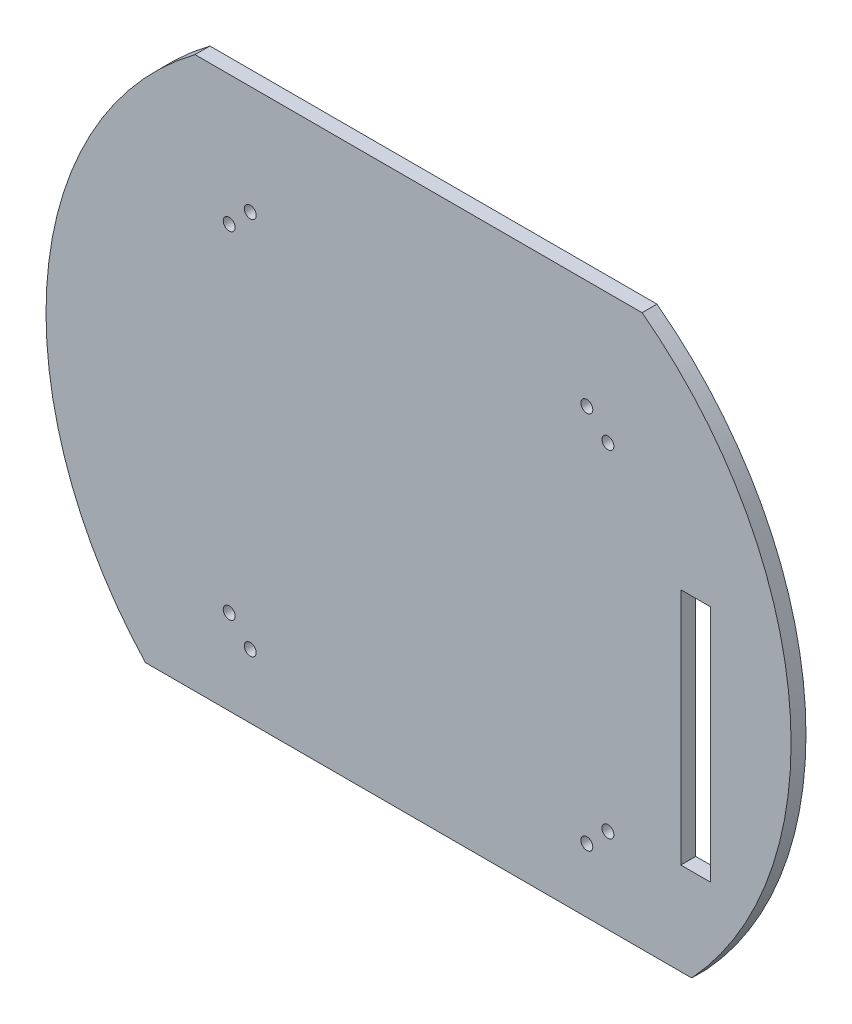
ISO-10303-21;
HEADER;
FILE_DESCRIPTION(('STEP AP214'),'2;1');
FILE_NAME('part.step','',(''),(''),'','','');
FILE_SCHEMA(('AUTOMOTIVE_DESIGN { 1 0 10303 214 1 1 1 1 }'));
ENDSEC;
DATA;
#1=APPLICATION_CONTEXT('core data for automotive mechanical design processes');
#2=APPLICATION_PROTOCOL_DEFINITION('international standard','automotive_design',2000,#1);
#3=PRODUCT_CONTEXT('',#1,'mechanical');
#4=PRODUCT('Part','Part','',(#3));
#5=PRODUCT_RELATED_PRODUCT_CATEGORY('part','',(#4));
#6=PRODUCT_DEFINITION_FORMATION('','',#4);
#7=PRODUCT_DEFINITION_CONTEXT('part definition',#1,'design');
#8=PRODUCT_DEFINITION('design','',#6,#7);
#9=PRODUCT_DEFINITION_SHAPE('','',#8);
#10=(LENGTH_UNIT() NAMED_UNIT(*) SI_UNIT(.MILLI.,.METRE.));
#11=(NAMED_UNIT(*) PLANE_ANGLE_UNIT() SI_UNIT($,.RADIAN.));
#12=(NAMED_UNIT(*) SI_UNIT($,.STERADIAN.) SOLID_ANGLE_UNIT());
#13=UNCERTAINTY_MEASURE_WITH_UNIT(LENGTH_MEASURE(1.E-05),#10,'distance_accuracy_value','');
#14=(GEOMETRIC_REPRESENTATION_CONTEXT(3) GLOBAL_UNCERTAINTY_ASSIGNED_CONTEXT((#13)) GLOBAL_UNIT_ASSIGNED_CONTEXT((#10,
#11,#12)) REPRESENTATION_CONTEXT('',''));
#15=CARTESIAN_POINT('',(0.,0.,0.));
#16=DIRECTION('',(0.,0.,1.));
#17=DIRECTION('',(1.,0.,0.));
#18=AXIS2_PLACEMENT_3D('',#15,#16,#17);
#19=CARTESIAN_POINT('',(0.,0.,5.));
#20=DIRECTION('',(0.,0.,-1.));
#21=DIRECTION('',(-1.,0.,0.));
#22=AXIS2_PLACEMENT_3D('',#19,#20,#21);
#23=CYLINDRICAL_SURFACE('',#22,125.);
#24=CARTESIAN_POINT('',(0.,0.,5.));
#25=DIRECTION('',(0.,0.,1.));
#26=DIRECTION('',(1.,0.,0.));
#27=AXIS2_PLACEMENT_3D('',#24,#25,#26);
#28=CIRCLE('',#27,125.);
#29=CARTESIAN_POINT('',(-75.,100.,5.));
#30=VERTEX_POINT('',#29);
#31=CARTESIAN_POINT('',(-91.6515138991168,-85.,5.));
#32=VERTEX_POINT('',#31);
#33=EDGE_CURVE('E41',#30,#32,#28,.T.);
#34=ORIENTED_EDGE('',*,*,#33,.F.);
#35=DIRECTION('',(0.,0.,1.));
#36=VECTOR('',#35,1.);
#37=CARTESIAN_POINT('',(-75.,100.,-0.00100000000000013));
#38=LINE('',#37,#36);
#39=CARTESIAN_POINT('',(-75.,100.,0.));
#40=VERTEX_POINT('',#39);
#41=EDGE_CURVE('E98',#40,#30,#38,.T.);
#42=ORIENTED_EDGE('',*,*,#41,.F.);
#43=CARTESIAN_POINT('',(0.,0.,0.));
#44=DIRECTION('',(0.,0.,1.));
#45=DIRECTION('',(1.,0.,0.));
#46=AXIS2_PLACEMENT_3D('',#43,#44,#45);
#47=CIRCLE('',#46,125.);
#48=CARTESIAN_POINT('',(-91.6515138991168,-85.,0.));
#49=VERTEX_POINT('',#48);
#50=EDGE_CURVE('E109',#40,#49,#47,.T.);
#51=ORIENTED_EDGE('',*,*,#50,.T.);
#52=DIRECTION('',(0.,0.,1.));
#53=VECTOR('',#52,1.);
#54=CARTESIAN_POINT('',(-91.6515138991168,-85.,-0.00100000000000013));
#55=LINE('',#54,#53);
#56=EDGE_CURVE('E168',#49,#32,#55,.T.);
#57=ORIENTED_EDGE('',*,*,#56,.T.);
#58=EDGE_LOOP('',(#34,#42,#51,#57));
#59=FACE_BOUND('',#58,.T.);
#60=ADVANCED_FACE('F32',(#59),#23,.T.);
#61=CARTESIAN_POINT('',(91.6515138991168,-85.,0.));
#62=VERTEX_POINT('',#61);
#63=CARTESIAN_POINT('',(75.,100.,0.));
#64=VERTEX_POINT('',#63);
#65=EDGE_CURVE('E36',#62,#64,#47,.T.);
#66=ORIENTED_EDGE('',*,*,#65,.T.);
#67=DIRECTION('',(0.,0.,1.));
#68=VECTOR('',#67,1.);
#69=CARTESIAN_POINT('',(75.,100.,-0.00100000000000013));
#70=LINE('',#69,#68);
#71=CARTESIAN_POINT('',(75.,100.,5.));
#72=VERTEX_POINT('',#71);
#73=EDGE_CURVE('E48',#64,#72,#70,.T.);
#74=ORIENTED_EDGE('',*,*,#73,.T.);
#75=CARTESIAN_POINT('',(91.6515138991168,-85.,5.));
#76=VERTEX_POINT('',#75);
#77=EDGE_CURVE('E11',#76,#72,#28,.T.);
#78=ORIENTED_EDGE('',*,*,#77,.F.);
#79=DIRECTION('',(0.,0.,1.));
#80=VECTOR('',#79,1.);
#81=CARTESIAN_POINT('',(91.6515138991168,-85.,-0.00100000000000013));
#82=LINE('',#81,#80);
#83=EDGE_CURVE('E169',#62,#76,#82,.T.);
#84=ORIENTED_EDGE('',*,*,#83,.F.);
#85=EDGE_LOOP('',(#66,#74,#78,#84));
#86=FACE_BOUND('',#85,.T.);
#87=ADVANCED_FACE('F34',(#86),#23,.T.);
#88=CARTESIAN_POINT('',(0.,0.,5.));
#89=DIRECTION('',(0.,0.,1.));
#90=DIRECTION('',(1.,0.,0.));
#91=AXIS2_PLACEMENT_3D('',#88,#89,#90);
#92=PLANE('',#91);
#93=DIRECTION('',(1.,0.,0.));
#94=VECTOR('',#93,1.);
#95=CARTESIAN_POINT('',(0.,100.,5.));
#96=LINE('',#95,#94);
#97=EDGE_CURVE('E111',#30,#72,#96,.T.);
#98=ORIENTED_EDGE('',*,*,#97,.F.);
#99=ORIENTED_EDGE('',*,*,#33,.T.);
#100=DIRECTION('',(-1.,0.,0.));
#101=VECTOR('',#100,1.);
#102=CARTESIAN_POINT('',(-91.6515138991168,-85.,5.));
#103=LINE('',#102,#101);
#104=EDGE_CURVE('E171',#76,#32,#103,.T.);
#105=ORIENTED_EDGE('',*,*,#104,.F.);
#106=ORIENTED_EDGE('',*,*,#77,.T.);
#107=EDGE_LOOP('',(#98,#99,#105,#106));
#108=FACE_BOUND('',#107,.T.);
#109=DIRECTION('',(0.,-1.,0.));
#110=VECTOR('',#109,1.);
#111=CARTESIAN_POINT('',(88.,-54.,5.));
#112=LINE('',#111,#110);
#113=CARTESIAN_POINT('',(88.,26.,5.));
#114=VERTEX_POINT('',#113);
#115=CARTESIAN_POINT('',(88.,-54.,5.));
#116=VERTEX_POINT('',#115);
#117=EDGE_CURVE('E56',#114,#116,#112,.T.);
#118=ORIENTED_EDGE('',*,*,#117,.F.);
#119=DIRECTION('',(-1.,0.,0.));
#120=VECTOR('',#119,1.);
#121=CARTESIAN_POINT('',(88.,26.,5.));
#122=LINE('',#121,#120);
#123=CARTESIAN_POINT('',(98.,26.,5.));
#124=VERTEX_POINT('',#123);
#125=EDGE_CURVE('E182',#124,#114,#122,.T.);
#126=ORIENTED_EDGE('',*,*,#125,.F.);
#127=DIRECTION('',(0.,1.,0.));
#128=VECTOR('',#127,1.);
#129=CARTESIAN_POINT('',(98.,-54.,5.));
#130=LINE('',#129,#128);
#131=CARTESIAN_POINT('',(98.,-54.,5.));
#132=VERTEX_POINT('',#131);
#133=EDGE_CURVE('E189',#132,#124,#130,.T.);
#134=ORIENTED_EDGE('',*,*,#133,.F.);
#135=DIRECTION('',(1.,0.,0.));
#136=VECTOR('',#135,1.);
#137=CARTESIAN_POINT('',(88.,-54.,5.));
#138=LINE('',#137,#136);
#139=EDGE_CURVE('E192',#116,#132,#138,.T.);
#140=ORIENTED_EDGE('',*,*,#139,.F.);
#141=EDGE_LOOP('',(#118,#126,#134,#140));
#142=FACE_BOUND('',#141,.T.);
#143=CARTESIAN_POINT('',(56.4644660940673,63.5355339059327,5.));
#144=DIRECTION('',(0.,0.,1.));
#145=DIRECTION('',(1.,0.,0.));
#146=AXIS2_PLACEMENT_3D('',#143,#144,#145);
#147=CIRCLE('',#146,2.);
#148=CARTESIAN_POINT('',(58.4644660940673,63.5355339059327,5.));
#149=VERTEX_POINT('',#148);
#150=EDGE_CURVE('E142',#149,#149,#147,.T.);
#151=ORIENTED_EDGE('',*,*,#150,.F.);
#152=EDGE_LOOP('',(#151));
#153=FACE_BOUND('',#152,.T.);
#154=CARTESIAN_POINT('',(-63.5355339059328,56.4644660940673,5.));
#155=DIRECTION('',(0.,0.,1.));
#156=DIRECTION('',(1.,0.,0.));
#157=AXIS2_PLACEMENT_3D('',#154,#155,#156);
#158=CIRCLE('',#157,2.);
#159=CARTESIAN_POINT('',(-61.5355339059328,56.4644660940673,5.));
#160=VERTEX_POINT('',#159);
#161=EDGE_CURVE('E141',#160,#160,#158,.T.);
#162=ORIENTED_EDGE('',*,*,#161,.F.);
#163=EDGE_LOOP('',(#162));
#164=FACE_BOUND('',#163,.T.);
#165=CARTESIAN_POINT('',(-56.4644660940673,63.5355339059328,5.));
#166=DIRECTION('',(0.,0.,1.));
#167=DIRECTION('',(1.,0.,0.));
#168=AXIS2_PLACEMENT_3D('',#165,#166,#167);
#169=CIRCLE('',#168,2.);
#170=CARTESIAN_POINT('',(-54.4644660940673,63.5355339059328,5.));
#171=VERTEX_POINT('',#170);
#172=EDGE_CURVE('E130',#171,#171,#169,.T.);
#173=ORIENTED_EDGE('',*,*,#172,.F.);
#174=EDGE_LOOP('',(#173));
#175=FACE_BOUND('',#174,.T.);
#176=CARTESIAN_POINT('',(-63.5355339059327,-56.4644660940673,5.));
#177=DIRECTION('',(0.,0.,1.));
#178=DIRECTION('',(1.,0.,0.));
#179=AXIS2_PLACEMENT_3D('',#176,#177,#178);
#180=CIRCLE('',#179,2.);
#181=CARTESIAN_POINT('',(-61.5355339059327,-56.4644660940673,5.));
#182=VERTEX_POINT('',#181);
#183=EDGE_CURVE('E129',#182,#182,#180,.T.);
#184=ORIENTED_EDGE('',*,*,#183,.F.);
#185=EDGE_LOOP('',(#184));
#186=FACE_BOUND('',#185,.T.);
#187=CARTESIAN_POINT('',(63.5355339059327,56.4644660940673,5.));
#188=DIRECTION('',(0.,0.,1.));
#189=DIRECTION('',(1.,0.,0.));
#190=AXIS2_PLACEMENT_3D('',#187,#188,#189);
#191=CIRCLE('',#190,2.);
#192=CARTESIAN_POINT('',(65.5355339059327,56.4644660940673,5.));
#193=VERTEX_POINT('',#192);
#194=EDGE_CURVE('E160',#193,#193,#191,.T.);
#195=ORIENTED_EDGE('',*,*,#194,.F.);
#196=EDGE_LOOP('',(#195));
#197=FACE_BOUND('',#196,.T.);
#198=CARTESIAN_POINT('',(63.5355339059327,-56.4644660940673,5.));
#199=DIRECTION('',(0.,0.,1.));
#200=DIRECTION('',(1.,0.,0.));
#201=AXIS2_PLACEMENT_3D('',#198,#199,#200);
#202=CIRCLE('',#201,2.);
#203=CARTESIAN_POINT('',(65.5355339059327,-56.4644660940673,5.));
#204=VERTEX_POINT('',#203);
#205=EDGE_CURVE('E153',#204,#204,#202,.T.);
#206=ORIENTED_EDGE('',*,*,#205,.F.);
#207=EDGE_LOOP('',(#206));
#208=FACE_BOUND('',#207,.T.);
#209=CARTESIAN_POINT('',(56.4644660940673,-63.5355339059327,5.));
#210=DIRECTION('',(0.,0.,1.));
#211=DIRECTION('',(1.,0.,0.));
#212=AXIS2_PLACEMENT_3D('',#209,#210,#211);
#213=CIRCLE('',#212,2.);
#214=CARTESIAN_POINT('',(58.4644660940673,-63.5355339059327,5.));
#215=VERTEX_POINT('',#214);
#216=EDGE_CURVE('E154',#215,#215,#213,.T.);
#217=ORIENTED_EDGE('',*,*,#216,.F.);
#218=EDGE_LOOP('',(#217));
#219=FACE_BOUND('',#218,.T.);
#220=CARTESIAN_POINT('',(-56.4644660940673,-63.5355339059327,5.));
#221=DIRECTION('',(0.,0.,1.));
#222=DIRECTION('',(1.,0.,0.));
#223=AXIS2_PLACEMENT_3D('',#220,#221,#222);
#224=CIRCLE('',#223,2.);
#225=CARTESIAN_POINT('',(-54.4644660940673,-63.5355339059327,5.));
#226=VERTEX_POINT('',#225);
#227=EDGE_CURVE('E118',#226,#226,#224,.T.);
#228=ORIENTED_EDGE('',*,*,#227,.F.);
#229=EDGE_LOOP('',(#228));
#230=FACE_BOUND('',#229,.T.);
#231=ADVANCED_FACE('F209',(#108,#142,#153,#164,#175,#186,#197,#208,#219,#230),#92,.T.);
#232=CARTESIAN_POINT('',(0.,0.,0.));
#233=DIRECTION('',(0.,0.,1.));
#234=DIRECTION('',(1.,0.,0.));
#235=AXIS2_PLACEMENT_3D('',#232,#233,#234);
#236=PLANE('',#235);
#237=DIRECTION('',(1.,0.,0.));
#238=VECTOR('',#237,1.);
#239=CARTESIAN_POINT('',(88.,26.,0.));
#240=LINE('',#239,#238);
#241=CARTESIAN_POINT('',(88.,26.,0.));
#242=VERTEX_POINT('',#241);
#243=CARTESIAN_POINT('',(98.,26.,0.));
#244=VERTEX_POINT('',#243);
#245=EDGE_CURVE('E199',#242,#244,#240,.T.);
#246=ORIENTED_EDGE('',*,*,#245,.F.);
#247=DIRECTION('',(0.,1.,0.));
#248=VECTOR('',#247,1.);
#249=CARTESIAN_POINT('',(88.,-54.,0.));
#250=LINE('',#249,#248);
#251=CARTESIAN_POINT('',(88.,-54.,0.));
#252=VERTEX_POINT('',#251);
#253=EDGE_CURVE('E196',#252,#242,#250,.T.);
#254=ORIENTED_EDGE('',*,*,#253,.F.);
#255=DIRECTION('',(-1.,0.,0.));
#256=VECTOR('',#255,1.);
#257=CARTESIAN_POINT('',(88.,-54.,0.));
#258=LINE('',#257,#256);
#259=CARTESIAN_POINT('',(98.,-54.,0.));
#260=VERTEX_POINT('',#259);
#261=EDGE_CURVE('E175',#260,#252,#258,.T.);
#262=ORIENTED_EDGE('',*,*,#261,.F.);
#263=DIRECTION('',(0.,-1.,0.));
#264=VECTOR('',#263,1.);
#265=CARTESIAN_POINT('',(98.,-54.,0.));
#266=LINE('',#265,#264);
#267=EDGE_CURVE('E104',#244,#260,#266,.T.);
#268=ORIENTED_EDGE('',*,*,#267,.F.);
#269=EDGE_LOOP('',(#246,#254,#262,#268));
#270=FACE_BOUND('',#269,.T.);
#271=CARTESIAN_POINT('',(56.4644660940673,63.5355339059327,0.));
#272=DIRECTION('',(0.,0.,1.));
#273=DIRECTION('',(1.,0.,0.));
#274=AXIS2_PLACEMENT_3D('',#271,#272,#273);
#275=CIRCLE('',#274,2.);
#276=CARTESIAN_POINT('',(58.4644660940673,63.5355339059327,0.));
#277=VERTEX_POINT('',#276);
#278=EDGE_CURVE('E138',#277,#277,#275,.F.);
#279=ORIENTED_EDGE('',*,*,#278,.F.);
#280=EDGE_LOOP('',(#279));
#281=FACE_BOUND('',#280,.T.);
#282=CARTESIAN_POINT('',(-63.5355339059328,56.4644660940673,0.));
#283=DIRECTION('',(0.,0.,1.));
#284=DIRECTION('',(1.,0.,0.));
#285=AXIS2_PLACEMENT_3D('',#282,#283,#284);
#286=CIRCLE('',#285,2.);
#287=CARTESIAN_POINT('',(-61.5355339059328,56.4644660940673,0.));
#288=VERTEX_POINT('',#287);
#289=EDGE_CURVE('E133',#288,#288,#286,.F.);
#290=ORIENTED_EDGE('',*,*,#289,.F.);
#291=EDGE_LOOP('',(#290));
#292=FACE_BOUND('',#291,.T.);
#293=CARTESIAN_POINT('',(-56.4644660940673,63.5355339059328,0.));
#294=DIRECTION('',(0.,0.,1.));
#295=DIRECTION('',(1.,0.,0.));
#296=AXIS2_PLACEMENT_3D('',#293,#294,#295);
#297=CIRCLE('',#296,2.);
#298=CARTESIAN_POINT('',(-54.4644660940673,63.5355339059328,0.));
#299=VERTEX_POINT('',#298);
#300=EDGE_CURVE('E126',#299,#299,#297,.F.);
#301=ORIENTED_EDGE('',*,*,#300,.F.);
#302=EDGE_LOOP('',(#301));
#303=FACE_BOUND('',#302,.T.);
#304=CARTESIAN_POINT('',(-63.5355339059327,-56.4644660940673,0.));
#305=DIRECTION('',(0.,0.,1.));
#306=DIRECTION('',(1.,0.,0.));
#307=AXIS2_PLACEMENT_3D('',#304,#305,#306);
#308=CIRCLE('',#307,2.);
#309=CARTESIAN_POINT('',(-61.5355339059327,-56.4644660940673,0.));
#310=VERTEX_POINT('',#309);
#311=EDGE_CURVE('E123',#310,#310,#308,.F.);
#312=ORIENTED_EDGE('',*,*,#311,.F.);
#313=EDGE_LOOP('',(#312));
#314=FACE_BOUND('',#313,.T.);
#315=CARTESIAN_POINT('',(63.5355339059327,56.4644660940673,0.));
#316=DIRECTION('',(0.,0.,1.));
#317=DIRECTION('',(1.,0.,0.));
#318=AXIS2_PLACEMENT_3D('',#315,#316,#317);
#319=CIRCLE('',#318,2.);
#320=CARTESIAN_POINT('',(65.5355339059327,56.4644660940673,0.));
#321=VERTEX_POINT('',#320);
#322=EDGE_CURVE('E145',#321,#321,#319,.F.);
#323=ORIENTED_EDGE('',*,*,#322,.F.);
#324=EDGE_LOOP('',(#323));
#325=FACE_BOUND('',#324,.T.);
#326=CARTESIAN_POINT('',(63.5355339059327,-56.4644660940673,0.));
#327=DIRECTION('',(0.,0.,1.));
#328=DIRECTION('',(1.,0.,0.));
#329=AXIS2_PLACEMENT_3D('',#326,#327,#328);
#330=CIRCLE('',#329,2.);
#331=CARTESIAN_POINT('',(65.5355339059327,-56.4644660940673,0.));
#332=VERTEX_POINT('',#331);
#333=EDGE_CURVE('E157',#332,#332,#330,.F.);
#334=ORIENTED_EDGE('',*,*,#333,.F.);
#335=EDGE_LOOP('',(#334));
#336=FACE_BOUND('',#335,.T.);
#337=CARTESIAN_POINT('',(56.4644660940673,-63.5355339059327,0.));
#338=DIRECTION('',(0.,0.,1.));
#339=DIRECTION('',(1.,0.,0.));
#340=AXIS2_PLACEMENT_3D('',#337,#338,#339);
#341=CIRCLE('',#340,2.);
#342=CARTESIAN_POINT('',(58.4644660940673,-63.5355339059327,0.));
#343=VERTEX_POINT('',#342);
#344=EDGE_CURVE('E150',#343,#343,#341,.F.);
#345=ORIENTED_EDGE('',*,*,#344,.F.);
#346=EDGE_LOOP('',(#345));
#347=FACE_BOUND('',#346,.T.);
#348=CARTESIAN_POINT('',(-56.4644660940673,-63.5355339059327,0.));
#349=DIRECTION('',(0.,0.,1.));
#350=DIRECTION('',(1.,0.,0.));
#351=AXIS2_PLACEMENT_3D('',#348,#349,#350);
#352=CIRCLE('',#351,2.);
#353=CARTESIAN_POINT('',(-54.4644660940673,-63.5355339059327,0.));
#354=VERTEX_POINT('',#353);
#355=EDGE_CURVE('E116',#354,#354,#352,.F.);
#356=ORIENTED_EDGE('',*,*,#355,.F.);
#357=EDGE_LOOP('',(#356));
#358=FACE_BOUND('',#357,.T.);
#359=ORIENTED_EDGE('',*,*,#50,.F.);
#360=DIRECTION('',(-1.,0.,0.));
#361=VECTOR('',#360,1.);
#362=CARTESIAN_POINT('',(0.,100.,0.));
#363=LINE('',#362,#361);
#364=EDGE_CURVE('E95',#64,#40,#363,.T.);
#365=ORIENTED_EDGE('',*,*,#364,.F.);
#366=ORIENTED_EDGE('',*,*,#65,.F.);
#367=DIRECTION('',(1.,0.,0.));
#368=VECTOR('',#367,1.);
#369=CARTESIAN_POINT('',(-91.6515138991168,-85.,0.));
#370=LINE('',#369,#368);
#371=EDGE_CURVE('E115',#49,#62,#370,.T.);
#372=ORIENTED_EDGE('',*,*,#371,.F.);
#373=EDGE_LOOP('',(#359,#365,#366,#372));
#374=FACE_BOUND('',#373,.T.);
#375=ADVANCED_FACE('F114',(#270,#281,#292,#303,#314,#325,#336,#347,#358,#374),#236,.F.);
#376=CARTESIAN_POINT('',(-56.4644660940673,-63.5355339059327,-0.00100000000000013));
#377=DIRECTION('',(0.,0.,1.));
#378=DIRECTION('',(1.,0.,0.));
#379=AXIS2_PLACEMENT_3D('',#376,#377,#378);
#380=CYLINDRICAL_SURFACE('',#379,2.);
#381=ORIENTED_EDGE('',*,*,#227,.T.);
#382=EDGE_LOOP('',(#381));
#383=FACE_BOUND('',#382,.T.);
#384=ORIENTED_EDGE('',*,*,#355,.T.);
#385=EDGE_LOOP('',(#384));
#386=FACE_BOUND('',#385,.T.);
#387=ADVANCED_FACE('F238',(#383,#386),#380,.F.);
#388=CARTESIAN_POINT('',(56.4644660940673,-63.5355339059327,-0.00100000000000013));
#389=DIRECTION('',(0.,0.,1.));
#390=DIRECTION('',(1.,0.,0.));
#391=AXIS2_PLACEMENT_3D('',#388,#389,#390);
#392=CYLINDRICAL_SURFACE('',#391,2.);
#393=ORIENTED_EDGE('',*,*,#216,.T.);
#394=EDGE_LOOP('',(#393));
#395=FACE_BOUND('',#394,.T.);
#396=ORIENTED_EDGE('',*,*,#344,.T.);
#397=EDGE_LOOP('',(#396));
#398=FACE_BOUND('',#397,.T.);
#399=ADVANCED_FACE('F243',(#395,#398),#392,.F.);
#400=CARTESIAN_POINT('',(63.5355339059327,-56.4644660940673,-0.00100000000000013));
#401=DIRECTION('',(0.,0.,1.));
#402=DIRECTION('',(1.,0.,0.));
#403=AXIS2_PLACEMENT_3D('',#400,#401,#402);
#404=CYLINDRICAL_SURFACE('',#403,2.);
#405=ORIENTED_EDGE('',*,*,#205,.T.);
#406=EDGE_LOOP('',(#405));
#407=FACE_BOUND('',#406,.T.);
#408=ORIENTED_EDGE('',*,*,#333,.T.);
#409=EDGE_LOOP('',(#408));
#410=FACE_BOUND('',#409,.T.);
#411=ADVANCED_FACE('F259',(#407,#410),#404,.F.);
#412=CARTESIAN_POINT('',(63.5355339059327,56.4644660940673,-0.00100000000000013));
#413=DIRECTION('',(0.,0.,1.));
#414=DIRECTION('',(1.,0.,0.));
#415=AXIS2_PLACEMENT_3D('',#412,#413,#414);
#416=CYLINDRICAL_SURFACE('',#415,2.);
#417=ORIENTED_EDGE('',*,*,#194,.T.);
#418=EDGE_LOOP('',(#417));
#419=FACE_BOUND('',#418,.T.);
#420=ORIENTED_EDGE('',*,*,#322,.T.);
#421=EDGE_LOOP('',(#420));
#422=FACE_BOUND('',#421,.T.);
#423=ADVANCED_FACE('F251',(#419,#422),#416,.F.);
#424=CARTESIAN_POINT('',(-63.5355339059327,-56.4644660940673,-0.00100000000000013));
#425=DIRECTION('',(0.,0.,1.));
#426=DIRECTION('',(1.,0.,0.));
#427=AXIS2_PLACEMENT_3D('',#424,#425,#426);
#428=CYLINDRICAL_SURFACE('',#427,2.);
#429=ORIENTED_EDGE('',*,*,#183,.T.);
#430=EDGE_LOOP('',(#429));
#431=FACE_BOUND('',#430,.T.);
#432=ORIENTED_EDGE('',*,*,#311,.T.);
#433=EDGE_LOOP('',(#432));
#434=FACE_BOUND('',#433,.T.);
#435=ADVANCED_FACE('F248',(#431,#434),#428,.F.);
#436=CARTESIAN_POINT('',(-56.4644660940673,63.5355339059328,-0.00100000000000013));
#437=DIRECTION('',(0.,0.,1.));
#438=DIRECTION('',(1.,0.,0.));
#439=AXIS2_PLACEMENT_3D('',#436,#437,#438);
#440=CYLINDRICAL_SURFACE('',#439,2.);
#441=ORIENTED_EDGE('',*,*,#172,.T.);
#442=EDGE_LOOP('',(#441));
#443=FACE_BOUND('',#442,.T.);
#444=ORIENTED_EDGE('',*,*,#300,.T.);
#445=EDGE_LOOP('',(#444));
#446=FACE_BOUND('',#445,.T.);
#447=ADVANCED_FACE('F245',(#443,#446),#440,.F.);
#448=CARTESIAN_POINT('',(-63.5355339059328,56.4644660940673,-0.00100000000000013));
#449=DIRECTION('',(0.,0.,1.));
#450=DIRECTION('',(1.,0.,0.));
#451=AXIS2_PLACEMENT_3D('',#448,#449,#450);
#452=CYLINDRICAL_SURFACE('',#451,2.);
#453=ORIENTED_EDGE('',*,*,#161,.T.);
#454=EDGE_LOOP('',(#453));
#455=FACE_BOUND('',#454,.T.);
#456=ORIENTED_EDGE('',*,*,#289,.T.);
#457=EDGE_LOOP('',(#456));
#458=FACE_BOUND('',#457,.T.);
#459=ADVANCED_FACE('F223',(#455,#458),#452,.F.);
#460=CARTESIAN_POINT('',(56.4644660940673,63.5355339059327,-0.00100000000000013));
#461=DIRECTION('',(0.,0.,1.));
#462=DIRECTION('',(1.,0.,0.));
#463=AXIS2_PLACEMENT_3D('',#460,#461,#462);
#464=CYLINDRICAL_SURFACE('',#463,2.);
#465=ORIENTED_EDGE('',*,*,#150,.T.);
#466=EDGE_LOOP('',(#465));
#467=FACE_BOUND('',#466,.T.);
#468=ORIENTED_EDGE('',*,*,#278,.T.);
#469=EDGE_LOOP('',(#468));
#470=FACE_BOUND('',#469,.T.);
#471=ADVANCED_FACE('F215',(#467,#470),#464,.F.);
#472=CARTESIAN_POINT('',(-91.6515138991168,-85.,-0.00100000000000013));
#473=DIRECTION('',(0.,1.,0.));
#474=DIRECTION('',(0.,0.,1.));
#475=AXIS2_PLACEMENT_3D('',#472,#473,#474);
#476=PLANE('',#475);
#477=ORIENTED_EDGE('',*,*,#371,.T.);
#478=ORIENTED_EDGE('',*,*,#83,.T.);
#479=ORIENTED_EDGE('',*,*,#104,.T.);
#480=ORIENTED_EDGE('',*,*,#56,.F.);
#481=EDGE_LOOP('',(#477,#478,#479,#480));
#482=FACE_BOUND('',#481,.T.);
#483=ADVANCED_FACE('F212',(#482),#476,.F.);
#484=CARTESIAN_POINT('',(88.,-54.,-0.00100000000000013));
#485=DIRECTION('',(-1.,0.,0.));
#486=DIRECTION('',(0.,0.,1.));
#487=AXIS2_PLACEMENT_3D('',#484,#485,#486);
#488=PLANE('',#487);
#489=ORIENTED_EDGE('',*,*,#253,.T.);
#490=DIRECTION('',(0.,0.,1.));
#491=VECTOR('',#490,1.);
#492=CARTESIAN_POINT('',(88.,26.,-0.00100000000000013));
#493=LINE('',#492,#491);
#494=EDGE_CURVE('E178',#242,#114,#493,.T.);
#495=ORIENTED_EDGE('',*,*,#494,.T.);
#496=ORIENTED_EDGE('',*,*,#117,.T.);
#497=DIRECTION('',(0.,0.,1.));
#498=VECTOR('',#497,1.);
#499=CARTESIAN_POINT('',(88.,-54.,-0.00100000000000013));
#500=LINE('',#499,#498);
#501=EDGE_CURVE('E179',#252,#116,#500,.T.);
#502=ORIENTED_EDGE('',*,*,#501,.F.);
#503=EDGE_LOOP('',(#489,#495,#496,#502));
#504=FACE_BOUND('',#503,.T.);
#505=ADVANCED_FACE('F214',(#504),#488,.F.);
#506=CARTESIAN_POINT('',(88.,26.,-0.00100000000000013));
#507=DIRECTION('',(0.,1.,0.));
#508=DIRECTION('',(0.,0.,1.));
#509=AXIS2_PLACEMENT_3D('',#506,#507,#508);
#510=PLANE('',#509);
#511=ORIENTED_EDGE('',*,*,#245,.T.);
#512=DIRECTION('',(0.,0.,1.));
#513=VECTOR('',#512,1.);
#514=CARTESIAN_POINT('',(98.,26.,-0.00100000000000013));
#515=LINE('',#514,#513);
#516=EDGE_CURVE('E184',#244,#124,#515,.T.);
#517=ORIENTED_EDGE('',*,*,#516,.T.);
#518=ORIENTED_EDGE('',*,*,#125,.T.);
#519=ORIENTED_EDGE('',*,*,#494,.F.);
#520=EDGE_LOOP('',(#511,#517,#518,#519));
#521=FACE_BOUND('',#520,.T.);
#522=ADVANCED_FACE('F221',(#521),#510,.F.);
#523=CARTESIAN_POINT('',(98.,-54.,-0.00100000000000013));
#524=DIRECTION('',(1.,0.,0.));
#525=DIRECTION('',(0.,0.,-1.));
#526=AXIS2_PLACEMENT_3D('',#523,#524,#525);
#527=PLANE('',#526);
#528=ORIENTED_EDGE('',*,*,#267,.T.);
#529=DIRECTION('',(0.,0.,1.));
#530=VECTOR('',#529,1.);
#531=CARTESIAN_POINT('',(98.,-54.,-0.00100000000000013));
#532=LINE('',#531,#530);
#533=EDGE_CURVE('E181',#260,#132,#532,.T.);
#534=ORIENTED_EDGE('',*,*,#533,.T.);
#535=ORIENTED_EDGE('',*,*,#133,.T.);
#536=ORIENTED_EDGE('',*,*,#516,.F.);
#537=EDGE_LOOP('',(#528,#534,#535,#536));
#538=FACE_BOUND('',#537,.T.);
#539=ADVANCED_FACE('F322',(#538),#527,.F.);
#540=CARTESIAN_POINT('',(88.,-54.,-0.00100000000000013));
#541=DIRECTION('',(0.,-1.,0.));
#542=DIRECTION('',(0.,0.,-1.));
#543=AXIS2_PLACEMENT_3D('',#540,#541,#542);
#544=PLANE('',#543);
#545=ORIENTED_EDGE('',*,*,#261,.T.);
#546=ORIENTED_EDGE('',*,*,#501,.T.);
#547=ORIENTED_EDGE('',*,*,#139,.T.);
#548=ORIENTED_EDGE('',*,*,#533,.F.);
#549=EDGE_LOOP('',(#545,#546,#547,#548));
#550=FACE_BOUND('',#549,.T.);
#551=ADVANCED_FACE('F332',(#550),#544,.F.);
#552=CARTESIAN_POINT('',(0.,100.,-0.00100000000000013));
#553=DIRECTION('',(0.,-1.,0.));
#554=DIRECTION('',(0.,0.,-1.));
#555=AXIS2_PLACEMENT_3D('',#552,#553,#554);
#556=PLANE('',#555);
#557=ORIENTED_EDGE('',*,*,#364,.T.);
#558=ORIENTED_EDGE('',*,*,#41,.T.);
#559=ORIENTED_EDGE('',*,*,#97,.T.);
#560=ORIENTED_EDGE('',*,*,#73,.F.);
#561=EDGE_LOOP('',(#557,#558,#559,#560));
#562=FACE_BOUND('',#561,.T.);
#563=ADVANCED_FACE('F97',(#562),#556,.F.);
#564=CLOSED_SHELL('',(#60,#87,#231,#375,#387,#399,#411,#423,#435,#447,#459,#471,#483,#505,#522,
#539,#551,#563));
#565=MANIFOLD_SOLID_BREP('B2',#564);
#566=ADVANCED_BREP_SHAPE_REPRESENTATION('',(#18,#565),#14);
#567=SHAPE_DEFINITION_REPRESENTATION(#9,#566);
ENDSEC;
END-ISO-10303-21;
